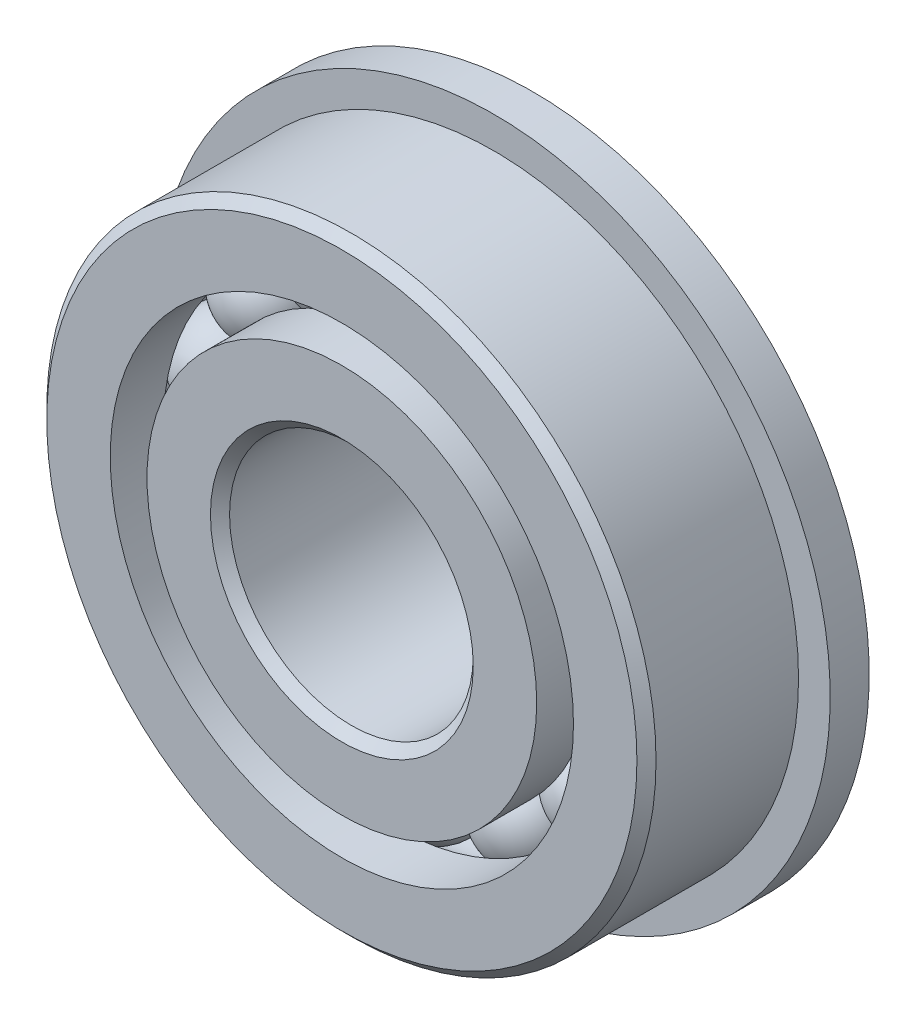
ISO-10303-21;
HEADER;
FILE_DESCRIPTION(('STEP AP214'),'2;1');
FILE_NAME('part.step','',(''),(''),'','','');
FILE_SCHEMA(('AUTOMOTIVE_DESIGN { 1 0 10303 214 1 1 1 1 }'));
ENDSEC;
DATA;
#1=APPLICATION_CONTEXT('core data for automotive mechanical design processes');
#2=APPLICATION_PROTOCOL_DEFINITION('international standard','automotive_design',2000,#1);
#3=PRODUCT_CONTEXT('',#1,'mechanical');
#4=PRODUCT('Part','Part','',(#3));
#5=PRODUCT_RELATED_PRODUCT_CATEGORY('part','',(#4));
#6=PRODUCT_DEFINITION_FORMATION('','',#4);
#7=PRODUCT_DEFINITION_CONTEXT('part definition',#1,'design');
#8=PRODUCT_DEFINITION('design','',#6,#7);
#9=PRODUCT_DEFINITION_SHAPE('','',#8);
#10=(LENGTH_UNIT() NAMED_UNIT(*) SI_UNIT(.MILLI.,.METRE.));
#11=(NAMED_UNIT(*) PLANE_ANGLE_UNIT() SI_UNIT($,.RADIAN.));
#12=(NAMED_UNIT(*) SI_UNIT($,.STERADIAN.) SOLID_ANGLE_UNIT());
#13=UNCERTAINTY_MEASURE_WITH_UNIT(LENGTH_MEASURE(1.E-05),#10,'distance_accuracy_value','');
#14=(GEOMETRIC_REPRESENTATION_CONTEXT(3) GLOBAL_UNCERTAINTY_ASSIGNED_CONTEXT((#13)) GLOBAL_UNIT_ASSIGNED_CONTEXT((#10,
#11,#12)) REPRESENTATION_CONTEXT('',''));
#15=CARTESIAN_POINT('',(0.,0.,0.));
#16=DIRECTION('',(0.,0.,1.));
#17=DIRECTION('',(1.,0.,0.));
#18=AXIS2_PLACEMENT_3D('',#15,#16,#17);
#19=CARTESIAN_POINT('',(-2.41076652547187,5.00600827228285,0.));
#20=DIRECTION('',(0.,0.,1.));
#21=DIRECTION('',(-0.433883739117546,0.900968867902425,0.));
#22=AXIS2_PLACEMENT_3D('',#19,#20,#21);
#23=SPHERICAL_SURFACE('',#22,1.20554465033679);
#24=CARTESIAN_POINT('',(-2.41076652547187,5.00600827228285,1.20554465033679));
#25=VERTEX_POINT('',#24);
#26=VERTEX_LOOP('',#25);
#27=FACE_BOUND('',#26,.T.);
#28=ADVANCED_FACE('F37',(#27),#23,.T.);
#29=CLOSED_SHELL('',(#28));
#30=MANIFOLD_SOLID_BREP('B2',#29);
#31=CARTESIAN_POINT('',(-4.34405117446295,3.46426521157764,0.));
#32=DIRECTION('',(0.,0.,1.));
#33=DIRECTION('',(-0.781831482468022,0.623489801858743,0.));
#34=AXIS2_PLACEMENT_3D('',#31,#32,#33);
#35=SPHERICAL_SURFACE('',#34,1.20554465033679);
#36=CARTESIAN_POINT('',(-4.34405117446295,3.46426521157764,1.20554465033679));
#37=VERTEX_POINT('',#36);
#38=VERTEX_LOOP('',#37);
#39=FACE_BOUND('',#38,.T.);
#40=ADVANCED_FACE('F57',(#39),#35,.T.);
#41=CLOSED_SHELL('',(#40));
#42=MANIFOLD_SOLID_BREP('B6',#41);
#43=CARTESIAN_POINT('',(-5.41694321206024,1.23638193929483,0.));
#44=DIRECTION('',(0.,0.,1.));
#45=DIRECTION('',(-0.974927912181821,0.222520933956325,0.));
#46=AXIS2_PLACEMENT_3D('',#43,#44,#45);
#47=SPHERICAL_SURFACE('',#46,1.20554465033679);
#48=CARTESIAN_POINT('',(-5.41694321206024,1.23638193929483,1.20554465033679));
#49=VERTEX_POINT('',#48);
#50=VERTEX_LOOP('',#49);
#51=FACE_BOUND('',#50,.T.);
#52=ADVANCED_FACE('F77',(#51),#47,.T.);
#53=CLOSED_SHELL('',(#52));
#54=MANIFOLD_SOLID_BREP('B33',#53);
#55=CARTESIAN_POINT('',(-5.41694321206027,-1.23638193929472,0.));
#56=DIRECTION('',(0.,0.,1.));
#57=DIRECTION('',(-0.974927912181826,-0.222520933956305,0.));
#58=AXIS2_PLACEMENT_3D('',#55,#56,#57);
#59=SPHERICAL_SURFACE('',#58,1.20554465033679);
#60=CARTESIAN_POINT('',(-5.41694321206027,-1.23638193929472,1.20554465033679));
#61=VERTEX_POINT('',#60);
#62=VERTEX_LOOP('',#61);
#63=FACE_BOUND('',#62,.T.);
#64=ADVANCED_FACE('F97',(#63),#59,.T.);
#65=CLOSED_SHELL('',(#64));
#66=MANIFOLD_SOLID_BREP('B53',#65);
#67=CARTESIAN_POINT('',(-4.34405117446302,-3.46426521157755,0.));
#68=DIRECTION('',(0.,0.,1.));
#69=DIRECTION('',(-0.781831482468035,-0.623489801858727,0.));
#70=AXIS2_PLACEMENT_3D('',#67,#68,#69);
#71=SPHERICAL_SURFACE('',#70,1.20554465033679);
#72=CARTESIAN_POINT('',(-4.34405117446302,-3.46426521157755,1.20554465033679));
#73=VERTEX_POINT('',#72);
#74=VERTEX_LOOP('',#73);
#75=FACE_BOUND('',#74,.T.);
#76=ADVANCED_FACE('F117',(#75),#71,.T.);
#77=CLOSED_SHELL('',(#76));
#78=MANIFOLD_SOLID_BREP('B73',#77);
#79=CARTESIAN_POINT('',(-2.41076652547197,-5.0060082722828,0.));
#80=DIRECTION('',(0.,0.,1.));
#81=DIRECTION('',(-0.433883739117565,-0.900968867902416,0.));
#82=AXIS2_PLACEMENT_3D('',#79,#80,#81);
#83=SPHERICAL_SURFACE('',#82,1.20554465033679);
#84=CARTESIAN_POINT('',(-2.41076652547197,-5.0060082722828,1.20554465033679));
#85=VERTEX_POINT('',#84);
#86=VERTEX_LOOP('',#85);
#87=FACE_BOUND('',#86,.T.);
#88=ADVANCED_FACE('F137',(#87),#83,.T.);
#89=CLOSED_SHELL('',(#88));
#90=MANIFOLD_SOLID_BREP('B93',#89);
#91=CARTESIAN_POINT('',(0.,-5.55625,0.));
#92=DIRECTION('',(0.,0.,1.));
#93=DIRECTION('',(0.,-1.,0.));
#94=AXIS2_PLACEMENT_3D('',#91,#92,#93);
#95=SPHERICAL_SURFACE('',#94,1.20554465033679);
#96=CARTESIAN_POINT('',(0.,-5.55625,1.20554465033679));
#97=VERTEX_POINT('',#96);
#98=VERTEX_LOOP('',#97);
#99=FACE_BOUND('',#98,.T.);
#100=ADVANCED_FACE('F157',(#99),#95,.T.);
#101=CLOSED_SHELL('',(#100));
#102=MANIFOLD_SOLID_BREP('B113',#101);
#103=CARTESIAN_POINT('',(2.4107665254719,-5.00600827228283,0.));
#104=DIRECTION('',(0.,0.,1.));
#105=DIRECTION('',(0.433883739117553,-0.900968867902422,0.));
#106=AXIS2_PLACEMENT_3D('',#103,#104,#105);
#107=SPHERICAL_SURFACE('',#106,1.20554465033679);
#108=CARTESIAN_POINT('',(2.4107665254719,-5.00600827228283,1.20554465033679));
#109=VERTEX_POINT('',#108);
#110=VERTEX_LOOP('',#109);
#111=FACE_BOUND('',#110,.T.);
#112=ADVANCED_FACE('F177',(#111),#107,.T.);
#113=CLOSED_SHELL('',(#112));
#114=MANIFOLD_SOLID_BREP('B133',#113);
#115=CARTESIAN_POINT('',(4.34405117446297,-3.46426521157761,0.));
#116=DIRECTION('',(0.,0.,1.));
#117=DIRECTION('',(0.781831482468027,-0.623489801858737,0.));
#118=AXIS2_PLACEMENT_3D('',#115,#116,#117);
#119=SPHERICAL_SURFACE('',#118,1.20554465033679);
#120=CARTESIAN_POINT('',(4.34405117446297,-3.46426521157761,1.20554465033679));
#121=VERTEX_POINT('',#120);
#122=VERTEX_LOOP('',#121);
#123=FACE_BOUND('',#122,.T.);
#124=ADVANCED_FACE('F197',(#123),#119,.T.);
#125=CLOSED_SHELL('',(#124));
#126=MANIFOLD_SOLID_BREP('B153',#125);
#127=CARTESIAN_POINT('',(5.41694321206025,-1.23638193929479,0.));
#128=DIRECTION('',(0.,0.,1.));
#129=DIRECTION('',(0.974927912181823,-0.222520933956318,0.));
#130=AXIS2_PLACEMENT_3D('',#127,#128,#129);
#131=SPHERICAL_SURFACE('',#130,1.20554465033679);
#132=CARTESIAN_POINT('',(5.41694321206025,-1.23638193929479,1.20554465033679));
#133=VERTEX_POINT('',#132);
#134=VERTEX_LOOP('',#133);
#135=FACE_BOUND('',#134,.T.);
#136=ADVANCED_FACE('F217',(#135),#131,.T.);
#137=CLOSED_SHELL('',(#136));
#138=MANIFOLD_SOLID_BREP('B173',#137);
#139=CARTESIAN_POINT('',(5.41694321206026,1.23638193929476,0.));
#140=DIRECTION('',(0.,0.,1.));
#141=DIRECTION('',(0.974927912181824,0.222520933956311,0.));
#142=AXIS2_PLACEMENT_3D('',#139,#140,#141);
#143=SPHERICAL_SURFACE('',#142,1.20554465033679);
#144=CARTESIAN_POINT('',(5.41694321206026,1.23638193929476,1.20554465033679));
#145=VERTEX_POINT('',#144);
#146=VERTEX_LOOP('',#145);
#147=FACE_BOUND('',#146,.T.);
#148=ADVANCED_FACE('F237',(#147),#143,.T.);
#149=CLOSED_SHELL('',(#148));
#150=MANIFOLD_SOLID_BREP('B193',#149);
#151=CARTESIAN_POINT('',(4.344051174463,3.46426521157758,0.));
#152=DIRECTION('',(0.,0.,1.));
#153=DIRECTION('',(0.781831482468031,0.623489801858732,0.));
#154=AXIS2_PLACEMENT_3D('',#151,#152,#153);
#155=SPHERICAL_SURFACE('',#154,1.20554465033679);
#156=CARTESIAN_POINT('',(4.344051174463,3.46426521157758,1.20554465033679));
#157=VERTEX_POINT('',#156);
#158=VERTEX_LOOP('',#157);
#159=FACE_BOUND('',#158,.T.);
#160=ADVANCED_FACE('F257',(#159),#155,.T.);
#161=CLOSED_SHELL('',(#160));
#162=MANIFOLD_SOLID_BREP('B213',#161);
#163=CARTESIAN_POINT('',(2.41076652547194,5.00600827228281,0.));
#164=DIRECTION('',(0.,0.,1.));
#165=DIRECTION('',(0.433883739117559,0.900968867902419,0.));
#166=AXIS2_PLACEMENT_3D('',#163,#164,#165);
#167=SPHERICAL_SURFACE('',#166,1.20554465033679);
#168=CARTESIAN_POINT('',(2.41076652547194,5.00600827228281,1.20554465033679));
#169=VERTEX_POINT('',#168);
#170=VERTEX_LOOP('',#169);
#171=FACE_BOUND('',#170,.T.);
#172=ADVANCED_FACE('F277',(#171),#167,.T.);
#173=CLOSED_SHELL('',(#172));
#174=MANIFOLD_SOLID_BREP('B233',#173);
#175=CARTESIAN_POINT('',(0.,5.55625,0.));
#176=DIRECTION('',(0.,0.,1.));
#177=DIRECTION('',(0.,1.,0.));
#178=AXIS2_PLACEMENT_3D('',#175,#176,#177);
#179=SPHERICAL_SURFACE('',#178,1.20554465033679);
#180=CARTESIAN_POINT('',(0.,5.55625,1.20554465033679));
#181=VERTEX_POINT('',#180);
#182=VERTEX_LOOP('',#181);
#183=FACE_BOUND('',#182,.T.);
#184=ADVANCED_FACE('F300',(#183),#179,.T.);
#185=CLOSED_SHELL('',(#184));
#186=MANIFOLD_SOLID_BREP('B253',#185);
#187=CARTESIAN_POINT('',(0.,5.07727857142857,2.4892));
#188=DIRECTION('',(0.,0.,-1.));
#189=DIRECTION('',(-1.,0.,0.));
#190=AXIS2_PLACEMENT_3D('',#187,#188,#189);
#191=PLANE('',#190);
#192=CARTESIAN_POINT('',(0.,0.,2.4892));
#193=DIRECTION('',(0.,0.,1.));
#194=DIRECTION('',(1.,0.,0.));
#195=AXIS2_PLACEMENT_3D('',#192,#193,#194);
#196=CIRCLE('',#195,3.42392);
#197=CARTESIAN_POINT('',(3.42392,0.,2.4892));
#198=VERTEX_POINT('',#197);
#199=EDGE_CURVE('E348',#198,#198,#196,.T.);
#200=ORIENTED_EDGE('',*,*,#199,.F.);
#201=EDGE_LOOP('',(#200));
#202=FACE_BOUND('',#201,.T.);
#203=CARTESIAN_POINT('',(0.,0.,2.4892));
#204=DIRECTION('',(0.,0.,1.));
#205=DIRECTION('',(1.,0.,0.));
#206=AXIS2_PLACEMENT_3D('',#203,#204,#205);
#207=CIRCLE('',#206,5.07727857142857);
#208=CARTESIAN_POINT('',(5.07727857142857,0.,2.4892));
#209=VERTEX_POINT('',#208);
#210=EDGE_CURVE('E299',#209,#209,#207,.T.);
#211=ORIENTED_EDGE('',*,*,#210,.T.);
#212=EDGE_LOOP('',(#211));
#213=FACE_BOUND('',#212,.T.);
#214=ADVANCED_FACE('F320',(#202,#213),#191,.F.);
#215=CARTESIAN_POINT('',(0.,0.,2.4892));
#216=DIRECTION('',(0.,0.,1.));
#217=DIRECTION('',(1.,0.,0.));
#218=AXIS2_PLACEMENT_3D('',#215,#216,#217);
#219=CYLINDRICAL_SURFACE('',#218,5.07727857142857);
#220=ORIENTED_EDGE('',*,*,#210,.F.);
#221=EDGE_LOOP('',(#220));
#222=FACE_BOUND('',#221,.T.);
#223=CARTESIAN_POINT('',(0.,0.,1.10631111111111));
#224=DIRECTION('',(0.,0.,1.));
#225=DIRECTION('',(1.,0.,0.));
#226=AXIS2_PLACEMENT_3D('',#223,#224,#225);
#227=CIRCLE('',#226,5.07727857142857);
#228=CARTESIAN_POINT('',(5.07727857142857,0.,1.10631111111111));
#229=VERTEX_POINT('',#228);
#230=EDGE_CURVE('E326',#229,#229,#227,.T.);
#231=ORIENTED_EDGE('',*,*,#230,.T.);
#232=EDGE_LOOP('',(#231));
#233=FACE_BOUND('',#232,.T.);
#234=ADVANCED_FACE('F355',(#222,#233),#219,.T.);
#235=CARTESIAN_POINT('',(0.,0.,0.));
#236=DIRECTION('',(0.,0.,1.));
#237=DIRECTION('',(1.,0.,0.));
#238=AXIS2_PLACEMENT_3D('',#235,#236,#237);
#239=TOROIDAL_SURFACE('',#238,5.55625,1.20554465033679);
#240=ORIENTED_EDGE('',*,*,#230,.F.);
#241=EDGE_LOOP('',(#240));
#242=FACE_BOUND('',#241,.T.);
#243=CARTESIAN_POINT('',(0.,0.,-1.10631111111111));
#244=DIRECTION('',(0.,0.,1.));
#245=DIRECTION('',(1.,0.,0.));
#246=AXIS2_PLACEMENT_3D('',#243,#244,#245);
#247=CIRCLE('',#246,5.07727857142857);
#248=CARTESIAN_POINT('',(5.07727857142857,0.,-1.10631111111111));
#249=VERTEX_POINT('',#248);
#250=EDGE_CURVE('E330',#249,#249,#247,.T.);
#251=ORIENTED_EDGE('',*,*,#250,.T.);
#252=EDGE_LOOP('',(#251));
#253=FACE_BOUND('',#252,.T.);
#254=ADVANCED_FACE('F359',(#242,#253),#239,.F.);
#255=CARTESIAN_POINT('',(0.,0.,2.4892));
#256=DIRECTION('',(0.,0.,1.));
#257=DIRECTION('',(1.,0.,0.));
#258=AXIS2_PLACEMENT_3D('',#255,#256,#257);
#259=CYLINDRICAL_SURFACE('',#258,5.07727857142857);
#260=ORIENTED_EDGE('',*,*,#250,.F.);
#261=EDGE_LOOP('',(#260));
#262=FACE_BOUND('',#261,.T.);
#263=CARTESIAN_POINT('',(0.,0.,-2.4892));
#264=DIRECTION('',(0.,0.,1.));
#265=DIRECTION('',(1.,0.,0.));
#266=AXIS2_PLACEMENT_3D('',#263,#264,#265);
#267=CIRCLE('',#266,5.07727857142857);
#268=CARTESIAN_POINT('',(5.07727857142857,0.,-2.4892));
#269=VERTEX_POINT('',#268);
#270=EDGE_CURVE('E334',#269,#269,#267,.T.);
#271=ORIENTED_EDGE('',*,*,#270,.T.);
#272=EDGE_LOOP('',(#271));
#273=FACE_BOUND('',#272,.T.);
#274=ADVANCED_FACE('F364',(#262,#273),#259,.T.);
#275=CARTESIAN_POINT('',(0.,3.42392,-2.4892));
#276=DIRECTION('',(0.,0.,1.));
#277=DIRECTION('',(1.,0.,0.));
#278=AXIS2_PLACEMENT_3D('',#275,#276,#277);
#279=PLANE('',#278);
#280=ORIENTED_EDGE('',*,*,#270,.F.);
#281=EDGE_LOOP('',(#280));
#282=FACE_BOUND('',#281,.T.);
#283=CARTESIAN_POINT('',(0.,0.,-2.4892));
#284=DIRECTION('',(0.,0.,1.));
#285=DIRECTION('',(1.,0.,0.));
#286=AXIS2_PLACEMENT_3D('',#283,#284,#285);
#287=CIRCLE('',#286,3.42392);
#288=CARTESIAN_POINT('',(3.42392,0.,-2.4892));
#289=VERTEX_POINT('',#288);
#290=EDGE_CURVE('E339',#289,#289,#287,.T.);
#291=ORIENTED_EDGE('',*,*,#290,.T.);
#292=EDGE_LOOP('',(#291));
#293=FACE_BOUND('',#292,.T.);
#294=ADVANCED_FACE('F370',(#282,#293),#279,.F.);
#295=CARTESIAN_POINT('',(0.,0.,-2.24028));
#296=DIRECTION('',(0.,0.,-1.));
#297=DIRECTION('',(-1.,0.,0.));
#298=AXIS2_PLACEMENT_3D('',#295,#296,#297);
#299=CONICAL_SURFACE('',#298,3.175,0.785398163397448);
#300=ORIENTED_EDGE('',*,*,#290,.F.);
#301=EDGE_LOOP('',(#300));
#302=FACE_BOUND('',#301,.T.);
#303=CARTESIAN_POINT('',(0.,0.,-2.24028));
#304=DIRECTION('',(0.,0.,1.));
#305=DIRECTION('',(1.,0.,0.));
#306=AXIS2_PLACEMENT_3D('',#303,#304,#305);
#307=CIRCLE('',#306,3.175);
#308=CARTESIAN_POINT('',(3.175,0.,-2.24028));
#309=VERTEX_POINT('',#308);
#310=EDGE_CURVE('E342',#309,#309,#307,.T.);
#311=ORIENTED_EDGE('',*,*,#310,.T.);
#312=EDGE_LOOP('',(#311));
#313=FACE_BOUND('',#312,.T.);
#314=ADVANCED_FACE('F374',(#302,#313),#299,.F.);
#315=CARTESIAN_POINT('',(0.,0.,2.4892));
#316=DIRECTION('',(0.,0.,1.));
#317=DIRECTION('',(1.,0.,0.));
#318=AXIS2_PLACEMENT_3D('',#315,#316,#317);
#319=CYLINDRICAL_SURFACE('',#318,3.175);
#320=ORIENTED_EDGE('',*,*,#310,.F.);
#321=EDGE_LOOP('',(#320));
#322=FACE_BOUND('',#321,.T.);
#323=CARTESIAN_POINT('',(0.,0.,2.24028));
#324=DIRECTION('',(0.,0.,1.));
#325=DIRECTION('',(1.,0.,0.));
#326=AXIS2_PLACEMENT_3D('',#323,#324,#325);
#327=CIRCLE('',#326,3.175);
#328=CARTESIAN_POINT('',(3.175,0.,2.24028));
#329=VERTEX_POINT('',#328);
#330=EDGE_CURVE('E345',#329,#329,#327,.T.);
#331=ORIENTED_EDGE('',*,*,#330,.T.);
#332=EDGE_LOOP('',(#331));
#333=FACE_BOUND('',#332,.T.);
#334=ADVANCED_FACE('F378',(#322,#333),#319,.F.);
#335=CARTESIAN_POINT('',(0.,0.,2.4892));
#336=DIRECTION('',(0.,0.,1.));
#337=DIRECTION('',(1.,0.,0.));
#338=AXIS2_PLACEMENT_3D('',#335,#336,#337);
#339=CONICAL_SURFACE('',#338,3.42392,0.785398163397447);
#340=ORIENTED_EDGE('',*,*,#330,.F.);
#341=EDGE_LOOP('',(#340));
#342=FACE_BOUND('',#341,.T.);
#343=ORIENTED_EDGE('',*,*,#199,.T.);
#344=EDGE_LOOP('',(#343));
#345=FACE_BOUND('',#344,.T.);
#346=ADVANCED_FACE('F352',(#342,#345),#339,.F.);
#347=CLOSED_SHELL('',(#214,#234,#254,#274,#294,#314,#334,#346));
#348=MANIFOLD_SOLID_BREP('B273',#347);
#349=CARTESIAN_POINT('',(0.,0.,2.24028));
#350=DIRECTION('',(0.,0.,-1.));
#351=DIRECTION('',(-1.,0.,0.));
#352=AXIS2_PLACEMENT_3D('',#349,#350,#351);
#353=CONICAL_SURFACE('',#352,7.9375,0.785398163397447);
#354=CARTESIAN_POINT('',(0.,0.,2.4892));
#355=DIRECTION('',(0.,0.,1.));
#356=DIRECTION('',(1.,0.,0.));
#357=AXIS2_PLACEMENT_3D('',#354,#355,#356);
#358=CIRCLE('',#357,7.68858);
#359=CARTESIAN_POINT('',(7.68858,0.,2.4892));
#360=VERTEX_POINT('',#359);
#361=EDGE_CURVE('E464',#360,#360,#358,.T.);
#362=ORIENTED_EDGE('',*,*,#361,.F.);
#363=EDGE_LOOP('',(#362));
#364=FACE_BOUND('',#363,.T.);
#365=CARTESIAN_POINT('',(0.,0.,2.24028));
#366=DIRECTION('',(0.,0.,1.));
#367=DIRECTION('',(1.,0.,0.));
#368=AXIS2_PLACEMENT_3D('',#365,#366,#367);
#369=CIRCLE('',#368,7.9375);
#370=CARTESIAN_POINT('',(7.9375,0.,2.24028));
#371=VERTEX_POINT('',#370);
#372=EDGE_CURVE('E319',#371,#371,#369,.T.);
#373=ORIENTED_EDGE('',*,*,#372,.T.);
#374=EDGE_LOOP('',(#373));
#375=FACE_BOUND('',#374,.T.);
#376=ADVANCED_FACE('F442',(#364,#375),#353,.T.);
#377=CARTESIAN_POINT('',(0.,0.,2.4892));
#378=DIRECTION('',(0.,0.,1.));
#379=DIRECTION('',(1.,0.,0.));
#380=AXIS2_PLACEMENT_3D('',#377,#378,#379);
#381=CYLINDRICAL_SURFACE('',#380,7.9375);
#382=CARTESIAN_POINT('',(0.,0.,-1.4732));
#383=DIRECTION('',(0.,0.,1.));
#384=DIRECTION('',(1.,0.,0.));
#385=AXIS2_PLACEMENT_3D('',#382,#383,#384);
#386=CIRCLE('',#385,7.9375);
#387=CARTESIAN_POINT('',(7.9375,0.,-1.4732));
#388=VERTEX_POINT('',#387);
#389=EDGE_CURVE('E445',#388,#388,#386,.T.);
#390=ORIENTED_EDGE('',*,*,#389,.T.);
#391=EDGE_LOOP('',(#390));
#392=FACE_BOUND('',#391,.T.);
#393=ORIENTED_EDGE('',*,*,#372,.F.);
#394=EDGE_LOOP('',(#393));
#395=FACE_BOUND('',#394,.T.);
#396=ADVANCED_FACE('F485',(#392,#395),#381,.T.);
#397=CARTESIAN_POINT('',(0.,7.68858,-2.4892));
#398=DIRECTION('',(0.,0.,1.));
#399=DIRECTION('',(1.,0.,0.));
#400=AXIS2_PLACEMENT_3D('',#397,#398,#399);
#401=PLANE('',#400);
#402=CARTESIAN_POINT('',(0.,0.,-2.4892));
#403=DIRECTION('',(0.,0.,1.));
#404=DIRECTION('',(1.,0.,0.));
#405=AXIS2_PLACEMENT_3D('',#402,#403,#404);
#406=CIRCLE('',#405,6.03522142857143);
#407=CARTESIAN_POINT('',(6.03522142857143,0.,-2.4892));
#408=VERTEX_POINT('',#407);
#409=EDGE_CURVE('E449',#408,#408,#406,.T.);
#410=ORIENTED_EDGE('',*,*,#409,.T.);
#411=EDGE_LOOP('',(#410));
#412=FACE_BOUND('',#411,.T.);
#413=CARTESIAN_POINT('',(0.,0.,-2.4892));
#414=DIRECTION('',(0.,0.,-1.));
#415=DIRECTION('',(-1.,0.,0.));
#416=AXIS2_PLACEMENT_3D('',#413,#414,#415);
#417=CIRCLE('',#416,8.763);
#418=CARTESIAN_POINT('',(-8.763,0.,-2.4892));
#419=VERTEX_POINT('',#418);
#420=EDGE_CURVE('E467',#419,#419,#417,.T.);
#421=ORIENTED_EDGE('',*,*,#420,.T.);
#422=EDGE_LOOP('',(#421));
#423=FACE_BOUND('',#422,.T.);
#424=ADVANCED_FACE('F488',(#412,#423),#401,.F.);
#425=CARTESIAN_POINT('',(0.,0.,2.4892));
#426=DIRECTION('',(0.,0.,1.));
#427=DIRECTION('',(1.,0.,0.));
#428=AXIS2_PLACEMENT_3D('',#425,#426,#427);
#429=CYLINDRICAL_SURFACE('',#428,6.03522142857143);
#430=ORIENTED_EDGE('',*,*,#409,.F.);
#431=EDGE_LOOP('',(#430));
#432=FACE_BOUND('',#431,.T.);
#433=CARTESIAN_POINT('',(0.,0.,-1.10631111111111));
#434=DIRECTION('',(0.,0.,1.));
#435=DIRECTION('',(1.,0.,0.));
#436=AXIS2_PLACEMENT_3D('',#433,#434,#435);
#437=CIRCLE('',#436,6.03522142857143);
#438=CARTESIAN_POINT('',(6.03522142857143,0.,-1.10631111111111));
#439=VERTEX_POINT('',#438);
#440=EDGE_CURVE('E453',#439,#439,#437,.T.);
#441=ORIENTED_EDGE('',*,*,#440,.T.);
#442=EDGE_LOOP('',(#441));
#443=FACE_BOUND('',#442,.T.);
#444=ADVANCED_FACE('F493',(#432,#443),#429,.F.);
#445=CARTESIAN_POINT('',(0.,0.,0.));
#446=DIRECTION('',(0.,0.,1.));
#447=DIRECTION('',(1.,0.,0.));
#448=AXIS2_PLACEMENT_3D('',#445,#446,#447);
#449=TOROIDAL_SURFACE('',#448,5.55625,1.20554465033679);
#450=ORIENTED_EDGE('',*,*,#440,.F.);
#451=EDGE_LOOP('',(#450));
#452=FACE_BOUND('',#451,.T.);
#453=CARTESIAN_POINT('',(0.,0.,1.10631111111111));
#454=DIRECTION('',(0.,0.,1.));
#455=DIRECTION('',(1.,0.,0.));
#456=AXIS2_PLACEMENT_3D('',#453,#454,#455);
#457=CIRCLE('',#456,6.03522142857143);
#458=CARTESIAN_POINT('',(6.03522142857143,0.,1.10631111111111));
#459=VERTEX_POINT('',#458);
#460=EDGE_CURVE('E458',#459,#459,#457,.T.);
#461=ORIENTED_EDGE('',*,*,#460,.T.);
#462=EDGE_LOOP('',(#461));
#463=FACE_BOUND('',#462,.T.);
#464=ADVANCED_FACE('F500',(#452,#463),#449,.F.);
#465=CARTESIAN_POINT('',(0.,0.,2.4892));
#466=DIRECTION('',(0.,0.,1.));
#467=DIRECTION('',(1.,0.,0.));
#468=AXIS2_PLACEMENT_3D('',#465,#466,#467);
#469=CYLINDRICAL_SURFACE('',#468,6.03522142857143);
#470=ORIENTED_EDGE('',*,*,#460,.F.);
#471=EDGE_LOOP('',(#470));
#472=FACE_BOUND('',#471,.T.);
#473=CARTESIAN_POINT('',(0.,0.,2.4892));
#474=DIRECTION('',(0.,0.,1.));
#475=DIRECTION('',(1.,0.,0.));
#476=AXIS2_PLACEMENT_3D('',#473,#474,#475);
#477=CIRCLE('',#476,6.03522142857143);
#478=CARTESIAN_POINT('',(6.03522142857143,0.,2.4892));
#479=VERTEX_POINT('',#478);
#480=EDGE_CURVE('E461',#479,#479,#477,.T.);
#481=ORIENTED_EDGE('',*,*,#480,.T.);
#482=EDGE_LOOP('',(#481));
#483=FACE_BOUND('',#482,.T.);
#484=ADVANCED_FACE('F504',(#472,#483),#469,.F.);
#485=CARTESIAN_POINT('',(0.,7.68858,2.4892));
#486=DIRECTION('',(0.,0.,-1.));
#487=DIRECTION('',(-1.,0.,0.));
#488=AXIS2_PLACEMENT_3D('',#485,#486,#487);
#489=PLANE('',#488);
#490=ORIENTED_EDGE('',*,*,#480,.F.);
#491=EDGE_LOOP('',(#490));
#492=FACE_BOUND('',#491,.T.);
#493=ORIENTED_EDGE('',*,*,#361,.T.);
#494=EDGE_LOOP('',(#493));
#495=FACE_BOUND('',#494,.T.);
#496=ADVANCED_FACE('F480',(#492,#495),#489,.F.);
#497=CARTESIAN_POINT('',(0.,6.86190071428571,-1.4732));
#498=DIRECTION('',(0.,0.,1.));
#499=DIRECTION('',(1.,0.,0.));
#500=AXIS2_PLACEMENT_3D('',#497,#498,#499);
#501=PLANE('',#500);
#502=CARTESIAN_POINT('',(0.,0.,-1.4732));
#503=DIRECTION('',(0.,0.,-1.));
#504=DIRECTION('',(-1.,0.,0.));
#505=AXIS2_PLACEMENT_3D('',#502,#503,#504);
#506=CIRCLE('',#505,8.763);
#507=CARTESIAN_POINT('',(-8.763,0.,-1.4732));
#508=VERTEX_POINT('',#507);
#509=EDGE_CURVE('E470',#508,#508,#506,.T.);
#510=ORIENTED_EDGE('',*,*,#509,.F.);
#511=EDGE_LOOP('',(#510));
#512=FACE_BOUND('',#511,.T.);
#513=ORIENTED_EDGE('',*,*,#389,.F.);
#514=EDGE_LOOP('',(#513));
#515=FACE_BOUND('',#514,.T.);
#516=ADVANCED_FACE('F477',(#512,#515),#501,.T.);
#517=CARTESIAN_POINT('',(0.,0.,-2.4892));
#518=DIRECTION('',(0.,0.,-1.));
#519=DIRECTION('',(-1.,0.,0.));
#520=AXIS2_PLACEMENT_3D('',#517,#518,#519);
#521=CYLINDRICAL_SURFACE('',#520,8.763);
#522=ORIENTED_EDGE('',*,*,#509,.T.);
#523=EDGE_LOOP('',(#522));
#524=FACE_BOUND('',#523,.T.);
#525=ORIENTED_EDGE('',*,*,#420,.F.);
#526=EDGE_LOOP('',(#525));
#527=FACE_BOUND('',#526,.T.);
#528=ADVANCED_FACE('F474',(#524,#527),#521,.T.);
#529=CLOSED_SHELL('',(#376,#396,#424,#444,#464,#484,#496,#516,#528));
#530=MANIFOLD_SOLID_BREP('B294',#529);
#531=ADVANCED_BREP_SHAPE_REPRESENTATION('',(#18,#30,#42,#54,#66,#78,#90,#102,#114,#126,#138,
#150,#162,#174,#186,#348,#530),#14);
#532=SHAPE_DEFINITION_REPRESENTATION(#9,#531);
ENDSEC;
END-ISO-10303-21;
